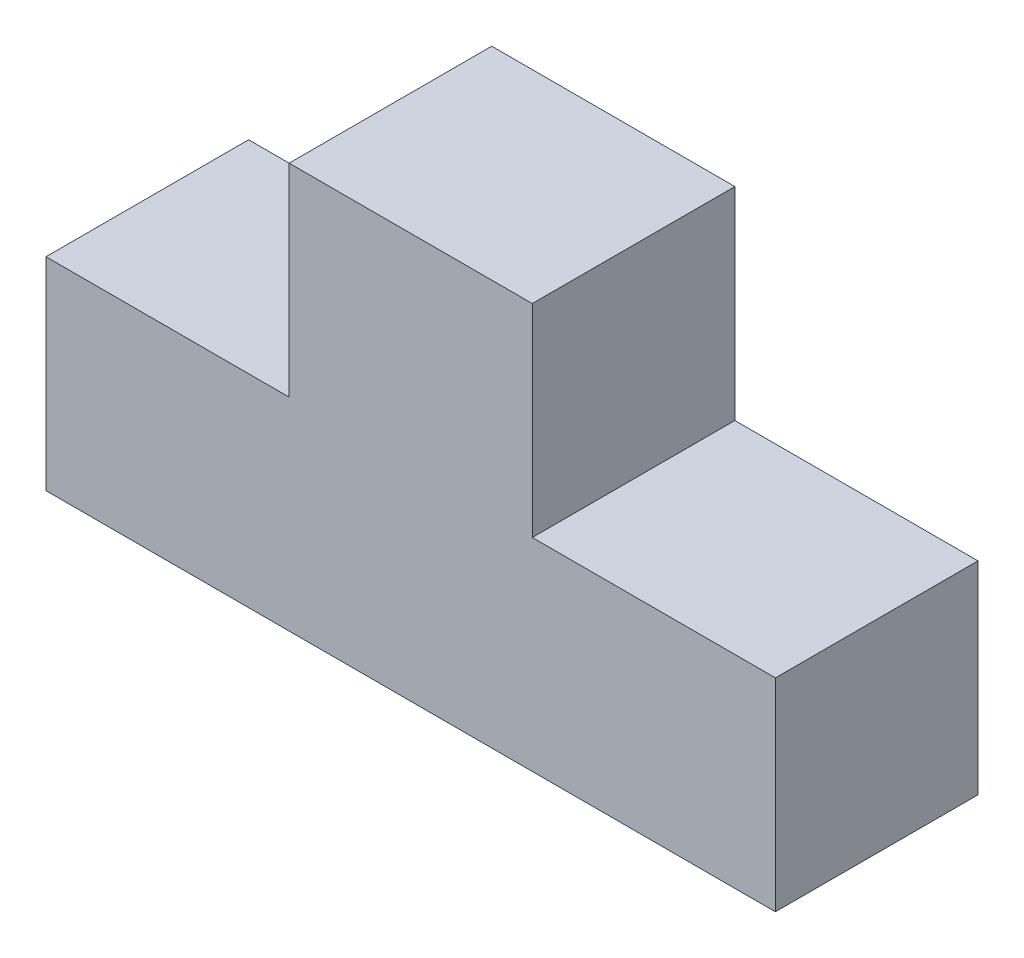
ISO-10303-21;
HEADER;
FILE_DESCRIPTION(('STEP AP214'),'2;1');
FILE_NAME('part.step','',(''),(''),'','','');
FILE_SCHEMA(('AUTOMOTIVE_DESIGN { 1 0 10303 214 1 1 1 1 }'));
ENDSEC;
DATA;
#1=APPLICATION_CONTEXT('core data for automotive mechanical design processes');
#2=APPLICATION_PROTOCOL_DEFINITION('international standard','automotive_design',2000,#1);
#3=PRODUCT_CONTEXT('',#1,'mechanical');
#4=PRODUCT('Part','Part','',(#3));
#5=PRODUCT_RELATED_PRODUCT_CATEGORY('part','',(#4));
#6=PRODUCT_DEFINITION_FORMATION('','',#4);
#7=PRODUCT_DEFINITION_CONTEXT('part definition',#1,'design');
#8=PRODUCT_DEFINITION('design','',#6,#7);
#9=PRODUCT_DEFINITION_SHAPE('','',#8);
#10=(LENGTH_UNIT() NAMED_UNIT(*) SI_UNIT(.MILLI.,.METRE.));
#11=(NAMED_UNIT(*) PLANE_ANGLE_UNIT() SI_UNIT($,.RADIAN.));
#12=(NAMED_UNIT(*) SI_UNIT($,.STERADIAN.) SOLID_ANGLE_UNIT());
#13=UNCERTAINTY_MEASURE_WITH_UNIT(LENGTH_MEASURE(1.E-05),#10,'distance_accuracy_value','');
#14=(GEOMETRIC_REPRESENTATION_CONTEXT(3) GLOBAL_UNCERTAINTY_ASSIGNED_CONTEXT((#13)) GLOBAL_UNIT_ASSIGNED_CONTEXT((#10,
#11,#12)) REPRESENTATION_CONTEXT('',''));
#15=CARTESIAN_POINT('',(0.,0.,0.));
#16=DIRECTION('',(0.,0.,1.));
#17=DIRECTION('',(1.,0.,0.));
#18=AXIS2_PLACEMENT_3D('',#15,#16,#17);
#19=CARTESIAN_POINT('',(0.,25.,25.));
#20=DIRECTION('',(1.,0.,0.));
#21=DIRECTION('',(0.,0.,-1.));
#22=AXIS2_PLACEMENT_3D('',#19,#20,#21);
#23=PLANE('',#22);
#24=DIRECTION('',(0.,-1.,0.));
#25=VECTOR('',#24,1.);
#26=CARTESIAN_POINT('',(0.,25.,0.));
#27=LINE('',#26,#25);
#28=CARTESIAN_POINT('',(0.,25.,0.));
#29=VERTEX_POINT('',#28);
#30=CARTESIAN_POINT('',(0.,0.,0.));
#31=VERTEX_POINT('',#30);
#32=EDGE_CURVE('E129',#29,#31,#27,.T.);
#33=ORIENTED_EDGE('',*,*,#32,.T.);
#34=DIRECTION('',(0.,0.,-1.));
#35=VECTOR('',#34,1.);
#36=CARTESIAN_POINT('',(0.,0.,25.));
#37=LINE('',#36,#35);
#38=CARTESIAN_POINT('',(0.,0.,25.));
#39=VERTEX_POINT('',#38);
#40=EDGE_CURVE('E11',#39,#31,#37,.T.);
#41=ORIENTED_EDGE('',*,*,#40,.F.);
#42=DIRECTION('',(0.,-1.,0.));
#43=VECTOR('',#42,1.);
#44=CARTESIAN_POINT('',(0.,25.,25.));
#45=LINE('',#44,#43);
#46=CARTESIAN_POINT('',(0.,25.,25.));
#47=VERTEX_POINT('',#46);
#48=EDGE_CURVE('E143',#47,#39,#45,.T.);
#49=ORIENTED_EDGE('',*,*,#48,.F.);
#50=DIRECTION('',(0.,0.,-1.));
#51=VECTOR('',#50,1.);
#52=CARTESIAN_POINT('',(0.,25.,25.));
#53=LINE('',#52,#51);
#54=EDGE_CURVE('E125',#47,#29,#53,.T.);
#55=ORIENTED_EDGE('',*,*,#54,.T.);
#56=EDGE_LOOP('',(#33,#41,#49,#55));
#57=FACE_BOUND('',#56,.T.);
#58=ADVANCED_FACE('F33',(#57),#23,.F.);
#59=CARTESIAN_POINT('',(0.,0.,25.));
#60=DIRECTION('',(0.,1.,0.));
#61=DIRECTION('',(0.,0.,1.));
#62=AXIS2_PLACEMENT_3D('',#59,#60,#61);
#63=PLANE('',#62);
#64=DIRECTION('',(1.,0.,0.));
#65=VECTOR('',#64,1.);
#66=CARTESIAN_POINT('',(0.,0.,0.));
#67=LINE('',#66,#65);
#68=CARTESIAN_POINT('',(90.,0.,0.));
#69=VERTEX_POINT('',#68);
#70=EDGE_CURVE('E132',#31,#69,#67,.T.);
#71=ORIENTED_EDGE('',*,*,#70,.T.);
#72=DIRECTION('',(0.,0.,-1.));
#73=VECTOR('',#72,1.);
#74=CARTESIAN_POINT('',(90.,0.,25.));
#75=LINE('',#74,#73);
#76=CARTESIAN_POINT('',(90.,0.,25.));
#77=VERTEX_POINT('',#76);
#78=EDGE_CURVE('E41',#77,#69,#75,.T.);
#79=ORIENTED_EDGE('',*,*,#78,.F.);
#80=DIRECTION('',(1.,0.,0.));
#81=VECTOR('',#80,1.);
#82=CARTESIAN_POINT('',(0.,0.,25.));
#83=LINE('',#82,#81);
#84=EDGE_CURVE('E92',#39,#77,#83,.T.);
#85=ORIENTED_EDGE('',*,*,#84,.F.);
#86=ORIENTED_EDGE('',*,*,#40,.T.);
#87=EDGE_LOOP('',(#71,#79,#85,#86));
#88=FACE_BOUND('',#87,.T.);
#89=ADVANCED_FACE('F178',(#88),#63,.F.);
#90=CARTESIAN_POINT('',(90.,0.,25.));
#91=DIRECTION('',(-1.,0.,0.));
#92=DIRECTION('',(0.,0.,1.));
#93=AXIS2_PLACEMENT_3D('',#90,#91,#92);
#94=PLANE('',#93);
#95=DIRECTION('',(0.,1.,0.));
#96=VECTOR('',#95,1.);
#97=CARTESIAN_POINT('',(90.,0.,0.));
#98=LINE('',#97,#96);
#99=CARTESIAN_POINT('',(90.,25.,0.));
#100=VERTEX_POINT('',#99);
#101=EDGE_CURVE('E134',#69,#100,#98,.T.);
#102=ORIENTED_EDGE('',*,*,#101,.T.);
#103=DIRECTION('',(0.,0.,-1.));
#104=VECTOR('',#103,1.);
#105=CARTESIAN_POINT('',(90.,25.,25.));
#106=LINE('',#105,#104);
#107=CARTESIAN_POINT('',(90.,25.,25.));
#108=VERTEX_POINT('',#107);
#109=EDGE_CURVE('E150',#108,#100,#106,.T.);
#110=ORIENTED_EDGE('',*,*,#109,.F.);
#111=DIRECTION('',(0.,1.,0.));
#112=VECTOR('',#111,1.);
#113=CARTESIAN_POINT('',(90.,0.,25.));
#114=LINE('',#113,#112);
#115=EDGE_CURVE('E158',#77,#108,#114,.T.);
#116=ORIENTED_EDGE('',*,*,#115,.F.);
#117=ORIENTED_EDGE('',*,*,#78,.T.);
#118=EDGE_LOOP('',(#102,#110,#116,#117));
#119=FACE_BOUND('',#118,.T.);
#120=ADVANCED_FACE('F156',(#119),#94,.F.);
#121=CARTESIAN_POINT('',(90.,25.,25.));
#122=DIRECTION('',(0.,-1.,0.));
#123=DIRECTION('',(1.,0.,0.));
#124=AXIS2_PLACEMENT_3D('',#121,#122,#123);
#125=PLANE('',#124);
#126=DIRECTION('',(-1.,0.,0.));
#127=VECTOR('',#126,1.);
#128=CARTESIAN_POINT('',(90.,25.,0.));
#129=LINE('',#128,#127);
#130=CARTESIAN_POINT('',(60.,25.,0.));
#131=VERTEX_POINT('',#130);
#132=EDGE_CURVE('E136',#100,#131,#129,.T.);
#133=ORIENTED_EDGE('',*,*,#132,.T.);
#134=DIRECTION('',(0.,0.,-1.));
#135=VECTOR('',#134,1.);
#136=CARTESIAN_POINT('',(60.,25.,25.));
#137=LINE('',#136,#135);
#138=CARTESIAN_POINT('',(60.,25.,25.));
#139=VERTEX_POINT('',#138);
#140=EDGE_CURVE('E147',#139,#131,#137,.T.);
#141=ORIENTED_EDGE('',*,*,#140,.F.);
#142=DIRECTION('',(-1.,0.,0.));
#143=VECTOR('',#142,1.);
#144=CARTESIAN_POINT('',(90.,25.,25.));
#145=LINE('',#144,#143);
#146=EDGE_CURVE('E170',#108,#139,#145,.T.);
#147=ORIENTED_EDGE('',*,*,#146,.F.);
#148=ORIENTED_EDGE('',*,*,#109,.T.);
#149=EDGE_LOOP('',(#133,#141,#147,#148));
#150=FACE_BOUND('',#149,.T.);
#151=ADVANCED_FACE('F166',(#150),#125,.F.);
#152=CARTESIAN_POINT('',(60.,25.,25.));
#153=DIRECTION('',(-1.,0.,0.));
#154=DIRECTION('',(0.,0.,1.));
#155=AXIS2_PLACEMENT_3D('',#152,#153,#154);
#156=PLANE('',#155);
#157=DIRECTION('',(0.,1.,0.));
#158=VECTOR('',#157,1.);
#159=CARTESIAN_POINT('',(60.,25.,0.));
#160=LINE('',#159,#158);
#161=CARTESIAN_POINT('',(60.,50.,0.));
#162=VERTEX_POINT('',#161);
#163=EDGE_CURVE('E138',#131,#162,#160,.T.);
#164=ORIENTED_EDGE('',*,*,#163,.T.);
#165=DIRECTION('',(0.,0.,-1.));
#166=VECTOR('',#165,1.);
#167=CARTESIAN_POINT('',(60.,50.,25.));
#168=LINE('',#167,#166);
#169=CARTESIAN_POINT('',(60.,50.,25.));
#170=VERTEX_POINT('',#169);
#171=EDGE_CURVE('E120',#170,#162,#168,.T.);
#172=ORIENTED_EDGE('',*,*,#171,.F.);
#173=DIRECTION('',(0.,1.,0.));
#174=VECTOR('',#173,1.);
#175=CARTESIAN_POINT('',(60.,25.,25.));
#176=LINE('',#175,#174);
#177=EDGE_CURVE('E111',#139,#170,#176,.T.);
#178=ORIENTED_EDGE('',*,*,#177,.F.);
#179=ORIENTED_EDGE('',*,*,#140,.T.);
#180=EDGE_LOOP('',(#164,#172,#178,#179));
#181=FACE_BOUND('',#180,.T.);
#182=ADVANCED_FACE('F169',(#181),#156,.F.);
#183=CARTESIAN_POINT('',(60.,50.,25.));
#184=DIRECTION('',(0.,-1.,0.));
#185=DIRECTION('',(1.,0.,0.));
#186=AXIS2_PLACEMENT_3D('',#183,#184,#185);
#187=PLANE('',#186);
#188=DIRECTION('',(-1.,0.,0.));
#189=VECTOR('',#188,1.);
#190=CARTESIAN_POINT('',(60.,50.,0.));
#191=LINE('',#190,#189);
#192=CARTESIAN_POINT('',(30.,50.,0.));
#193=VERTEX_POINT('',#192);
#194=EDGE_CURVE('E119',#162,#193,#191,.T.);
#195=ORIENTED_EDGE('',*,*,#194,.T.);
#196=DIRECTION('',(0.,0.,-1.));
#197=VECTOR('',#196,1.);
#198=CARTESIAN_POINT('',(30.,50.,25.));
#199=LINE('',#198,#197);
#200=CARTESIAN_POINT('',(30.,50.,25.));
#201=VERTEX_POINT('',#200);
#202=EDGE_CURVE('E116',#201,#193,#199,.T.);
#203=ORIENTED_EDGE('',*,*,#202,.F.);
#204=DIRECTION('',(-1.,0.,0.));
#205=VECTOR('',#204,1.);
#206=CARTESIAN_POINT('',(60.,50.,25.));
#207=LINE('',#206,#205);
#208=EDGE_CURVE('E105',#170,#201,#207,.T.);
#209=ORIENTED_EDGE('',*,*,#208,.F.);
#210=ORIENTED_EDGE('',*,*,#171,.T.);
#211=EDGE_LOOP('',(#195,#203,#209,#210));
#212=FACE_BOUND('',#211,.T.);
#213=ADVANCED_FACE('F117',(#212),#187,.F.);
#214=CARTESIAN_POINT('',(30.,50.,25.));
#215=DIRECTION('',(1.,0.,0.));
#216=DIRECTION('',(0.,1.,0.));
#217=AXIS2_PLACEMENT_3D('',#214,#215,#216);
#218=PLANE('',#217);
#219=DIRECTION('',(0.,-1.,0.));
#220=VECTOR('',#219,1.);
#221=CARTESIAN_POINT('',(30.,50.,0.));
#222=LINE('',#221,#220);
#223=CARTESIAN_POINT('',(30.,25.,0.));
#224=VERTEX_POINT('',#223);
#225=EDGE_CURVE('E78',#193,#224,#222,.T.);
#226=ORIENTED_EDGE('',*,*,#225,.T.);
#227=DIRECTION('',(0.,0.,-1.));
#228=VECTOR('',#227,1.);
#229=CARTESIAN_POINT('',(30.,25.,25.));
#230=LINE('',#229,#228);
#231=CARTESIAN_POINT('',(30.,25.,25.));
#232=VERTEX_POINT('',#231);
#233=EDGE_CURVE('E121',#232,#224,#230,.T.);
#234=ORIENTED_EDGE('',*,*,#233,.F.);
#235=DIRECTION('',(0.,-1.,0.));
#236=VECTOR('',#235,1.);
#237=CARTESIAN_POINT('',(30.,50.,25.));
#238=LINE('',#237,#236);
#239=EDGE_CURVE('E109',#201,#232,#238,.T.);
#240=ORIENTED_EDGE('',*,*,#239,.F.);
#241=ORIENTED_EDGE('',*,*,#202,.T.);
#242=EDGE_LOOP('',(#226,#234,#240,#241));
#243=FACE_BOUND('',#242,.T.);
#244=ADVANCED_FACE('F123',(#243),#218,.F.);
#245=CARTESIAN_POINT('',(30.,25.,25.));
#246=DIRECTION('',(0.,-1.,0.));
#247=DIRECTION('',(1.,0.,0.));
#248=AXIS2_PLACEMENT_3D('',#245,#246,#247);
#249=PLANE('',#248);
#250=DIRECTION('',(-1.,0.,0.));
#251=VECTOR('',#250,1.);
#252=CARTESIAN_POINT('',(30.,25.,0.));
#253=LINE('',#252,#251);
#254=EDGE_CURVE('E84',#224,#29,#253,.T.);
#255=ORIENTED_EDGE('',*,*,#254,.T.);
#256=ORIENTED_EDGE('',*,*,#54,.F.);
#257=DIRECTION('',(-1.,0.,0.));
#258=VECTOR('',#257,1.);
#259=CARTESIAN_POINT('',(30.,25.,25.));
#260=LINE('',#259,#258);
#261=EDGE_CURVE('E49',#232,#47,#260,.T.);
#262=ORIENTED_EDGE('',*,*,#261,.F.);
#263=ORIENTED_EDGE('',*,*,#233,.T.);
#264=EDGE_LOOP('',(#255,#256,#262,#263));
#265=FACE_BOUND('',#264,.T.);
#266=ADVANCED_FACE('F194',(#265),#249,.F.);
#267=CARTESIAN_POINT('',(0.,0.,25.));
#268=DIRECTION('',(0.,0.,1.));
#269=DIRECTION('',(1.,0.,0.));
#270=AXIS2_PLACEMENT_3D('',#267,#268,#269);
#271=PLANE('',#270);
#272=ORIENTED_EDGE('',*,*,#48,.T.);
#273=ORIENTED_EDGE('',*,*,#84,.T.);
#274=ORIENTED_EDGE('',*,*,#115,.T.);
#275=ORIENTED_EDGE('',*,*,#146,.T.);
#276=ORIENTED_EDGE('',*,*,#177,.T.);
#277=ORIENTED_EDGE('',*,*,#208,.T.);
#278=ORIENTED_EDGE('',*,*,#239,.T.);
#279=ORIENTED_EDGE('',*,*,#261,.T.);
#280=EDGE_LOOP('',(#272,#273,#274,#275,#276,#277,#278,#279));
#281=FACE_BOUND('',#280,.T.);
#282=ADVANCED_FACE('F107',(#281),#271,.T.);
#283=CARTESIAN_POINT('',(0.,0.,0.));
#284=DIRECTION('',(0.,0.,1.));
#285=DIRECTION('',(1.,0.,0.));
#286=AXIS2_PLACEMENT_3D('',#283,#284,#285);
#287=PLANE('',#286);
#288=ORIENTED_EDGE('',*,*,#32,.F.);
#289=ORIENTED_EDGE('',*,*,#254,.F.);
#290=ORIENTED_EDGE('',*,*,#225,.F.);
#291=ORIENTED_EDGE('',*,*,#194,.F.);
#292=ORIENTED_EDGE('',*,*,#163,.F.);
#293=ORIENTED_EDGE('',*,*,#132,.F.);
#294=ORIENTED_EDGE('',*,*,#101,.F.);
#295=ORIENTED_EDGE('',*,*,#70,.F.);
#296=EDGE_LOOP('',(#288,#289,#290,#291,#292,#293,#294,#295));
#297=FACE_BOUND('',#296,.T.);
#298=ADVANCED_FACE('F162',(#297),#287,.F.);
#299=CLOSED_SHELL('',(#58,#89,#120,#151,#182,#213,#244,#266,#282,#298));
#300=MANIFOLD_SOLID_BREP('B2',#299);
#301=ADVANCED_BREP_SHAPE_REPRESENTATION('',(#18,#300),#14);
#302=SHAPE_DEFINITION_REPRESENTATION(#9,#301);
ENDSEC;
END-ISO-10303-21;
